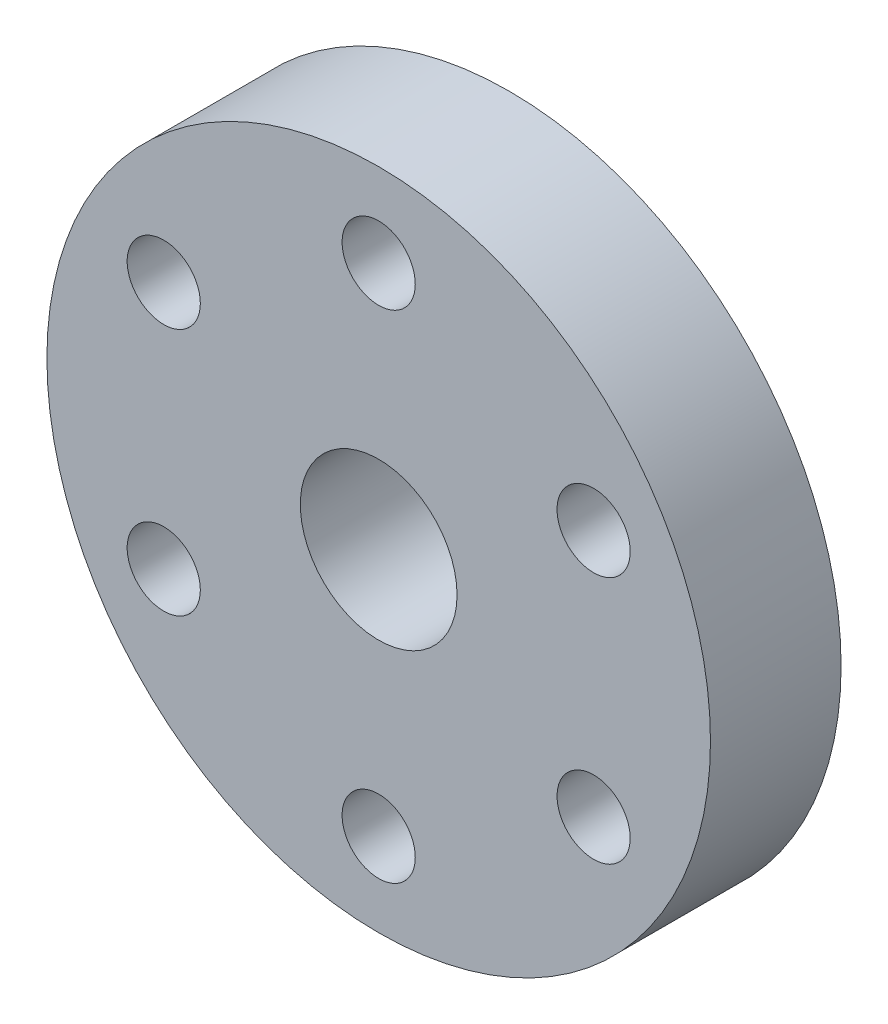
ISO-10303-21;
HEADER;
FILE_DESCRIPTION(('STEP AP214'),'2;1');
FILE_NAME('part.step','',(''),(''),'','','');
FILE_SCHEMA(('AUTOMOTIVE_DESIGN { 1 0 10303 214 1 1 1 1 }'));
ENDSEC;
DATA;
#1=APPLICATION_CONTEXT('core data for automotive mechanical design processes');
#2=APPLICATION_PROTOCOL_DEFINITION('international standard','automotive_design',2000,#1);
#3=PRODUCT_CONTEXT('',#1,'mechanical');
#4=PRODUCT('Part','Part','',(#3));
#5=PRODUCT_RELATED_PRODUCT_CATEGORY('part','',(#4));
#6=PRODUCT_DEFINITION_FORMATION('','',#4);
#7=PRODUCT_DEFINITION_CONTEXT('part definition',#1,'design');
#8=PRODUCT_DEFINITION('design','',#6,#7);
#9=PRODUCT_DEFINITION_SHAPE('','',#8);
#10=(LENGTH_UNIT() NAMED_UNIT(*) SI_UNIT(.MILLI.,.METRE.));
#11=(NAMED_UNIT(*) PLANE_ANGLE_UNIT() SI_UNIT($,.RADIAN.));
#12=(NAMED_UNIT(*) SI_UNIT($,.STERADIAN.) SOLID_ANGLE_UNIT());
#13=UNCERTAINTY_MEASURE_WITH_UNIT(LENGTH_MEASURE(1.E-05),#10,'distance_accuracy_value','');
#14=(GEOMETRIC_REPRESENTATION_CONTEXT(3) GLOBAL_UNCERTAINTY_ASSIGNED_CONTEXT((#13)) GLOBAL_UNIT_ASSIGNED_CONTEXT((#10,
#11,#12)) REPRESENTATION_CONTEXT('',''));
#15=CARTESIAN_POINT('',(0.,0.,0.));
#16=DIRECTION('',(0.,0.,1.));
#17=DIRECTION('',(1.,0.,0.));
#18=AXIS2_PLACEMENT_3D('',#15,#16,#17);
#19=CARTESIAN_POINT('',(0.,0.,0.));
#20=DIRECTION('',(0.,0.,1.));
#21=DIRECTION('',(1.,0.,0.));
#22=AXIS2_PLACEMENT_3D('',#19,#20,#21);
#23=PLANE('',#22);
#24=CARTESIAN_POINT('',(0.,0.,0.));
#25=DIRECTION('',(0.,0.,1.));
#26=DIRECTION('',(1.,0.,0.));
#27=AXIS2_PLACEMENT_3D('',#24,#25,#26);
#28=CIRCLE('',#27,6.);
#29=CARTESIAN_POINT('',(6.,0.,0.));
#30=VERTEX_POINT('',#29);
#31=EDGE_CURVE('E47',#30,#30,#28,.T.);
#32=ORIENTED_EDGE('',*,*,#31,.F.);
#33=EDGE_LOOP('',(#32));
#34=FACE_BOUND('',#33,.T.);
#35=CARTESIAN_POINT('',(0.,0.,0.));
#36=DIRECTION('',(0.,0.,1.));
#37=DIRECTION('',(1.,0.,0.));
#38=AXIS2_PLACEMENT_3D('',#35,#36,#37);
#39=CIRCLE('',#38,3.);
#40=CARTESIAN_POINT('',(3.,0.,0.));
#41=VERTEX_POINT('',#40);
#42=EDGE_CURVE('E52',#41,#41,#39,.T.);
#43=ORIENTED_EDGE('',*,*,#42,.T.);
#44=EDGE_LOOP('',(#43));
#45=FACE_BOUND('',#44,.T.);
#46=ADVANCED_FACE('F34',(#34,#45),#23,.F.);
#47=CARTESIAN_POINT('',(0.,0.,4.2));
#48=DIRECTION('',(0.,0.,-1.));
#49=DIRECTION('',(-1.,0.,0.));
#50=AXIS2_PLACEMENT_3D('',#47,#48,#49);
#51=CYLINDRICAL_SURFACE('',#50,6.);
#52=CARTESIAN_POINT('',(0.,-6.,3.5));
#53=CARTESIAN_POINT('',(0.0775136551808606,-5.99999860462077,3.49999755049782));
#54=CARTESIAN_POINT('',(0.155055852180418,-5.99848277720663,3.49354075895642));
#55=CARTESIAN_POINT('',(0.307928711689404,-5.99258245110673,3.46791633869285));
#56=CARTESIAN_POINT('',(0.383257908738774,-5.98819609437492,3.44874047701852));
#57=CARTESIAN_POINT('',(0.529474135819814,-5.97704189804572,3.39831831024663));
#58=CARTESIAN_POINT('',(0.600366020559867,-5.97027671664972,3.3670854743364));
#59=CARTESIAN_POINT('',(0.735902456221209,-5.95509063862421,3.29348083405209));
#60=CARTESIAN_POINT('',(0.800546997673411,-5.94666973948518,3.25110901279503));
#61=CARTESIAN_POINT('',(0.922925959248793,-5.92892044055307,3.15561764001887));
#62=CARTESIAN_POINT('',(0.980531045796356,-5.91957951935363,3.10233465382949));
#63=CARTESIAN_POINT('',(1.08607323847069,-5.90112886617325,2.98688389689762));
#64=CARTESIAN_POINT('',(1.13400938392729,-5.89201915724322,2.92471524435569));
#65=CARTESIAN_POINT('',(1.21944051732307,-5.87493771504315,2.79227998295129));
#66=CARTESIAN_POINT('',(1.25679466710317,-5.86698196255307,2.72192027567549));
#67=CARTESIAN_POINT('',(1.31909703704768,-5.85329030120377,2.57570531126446));
#68=CARTESIAN_POINT('',(1.34404696295362,-5.84755408715332,2.49985081137896));
#69=CARTESIAN_POINT('',(1.38039896443522,-5.83907906254273,2.34621138233285));
#70=CARTESIAN_POINT('',(1.39203167018675,-5.83628929295491,2.26848389510077));
#71=CARTESIAN_POINT('',(1.40213672759817,-5.83387021717826,2.11213439110955));
#72=CARTESIAN_POINT('',(1.40061093007045,-5.83424046651614,2.03351250170633));
#73=CARTESIAN_POINT('',(1.38462717006806,-5.83805360607404,1.87934410285429));
#74=CARTESIAN_POINT('',(1.37044019131594,-5.84143210805626,1.80376766136065));
#75=CARTESIAN_POINT('',(1.32996743878963,-5.85077891648779,1.65609814039352));
#76=CARTESIAN_POINT('',(1.30368090292846,-5.85674738606408,1.58400528064847));
#77=CARTESIAN_POINT('',(1.23951455308861,-5.87066310630364,1.44460351510235));
#78=CARTESIAN_POINT('',(1.20153320055199,-5.87862756950202,1.37734313734968));
#79=CARTESIAN_POINT('',(1.11512658099994,-5.89562771298769,1.25005155389481));
#80=CARTESIAN_POINT('',(1.06669970611106,-5.90466355809567,1.19002146336614));
#81=CARTESIAN_POINT('',(0.959356121021581,-5.92306231054005,1.07733750874245));
#82=CARTESIAN_POINT('',(0.900209750657103,-5.93242778207154,1.02490259657541));
#83=CARTESIAN_POINT('',(0.77385399055564,-5.95022809072843,0.93065747543382));
#84=CARTESIAN_POINT('',(0.706644412992491,-5.95866290616613,0.888847514030046));
#85=CARTESIAN_POINT('',(0.565782506984416,-5.97368513329122,0.816973308242645));
#86=CARTESIAN_POINT('',(0.492113392403213,-5.98026753264178,0.786940847183003));
#87=CARTESIAN_POINT('',(0.340585615176868,-5.99080645286014,0.739744288534925));
#88=CARTESIAN_POINT('',(0.262727650306185,-5.99476340961636,0.72257805477302));
#89=CARTESIAN_POINT('',(0.106907588460029,-5.99954244402773,0.70192686366759));
#90=CARTESIAN_POINT('',(0.0289871166552413,-6.00043294383207,0.698143245718862));
#91=CARTESIAN_POINT('',(-0.126372845528744,-5.99917188382708,0.703550834630745));
#92=CARTESIAN_POINT('',(-0.203812372830682,-5.99702056051609,0.7127410327916));
#93=CARTESIAN_POINT('',(-0.355000856153422,-5.98996106858808,0.74358830502789));
#94=CARTESIAN_POINT('',(-0.428784148664062,-5.9850881879476,0.765085887975081));
#95=CARTESIAN_POINT('',(-0.571695899544112,-5.97313240187964,0.819758347367704));
#96=CARTESIAN_POINT('',(-0.640823925050002,-5.96604929128103,0.852934307929705));
#97=CARTESIAN_POINT('',(-0.773676865632761,-5.95029195840437,0.930624301545468));
#98=CARTESIAN_POINT('',(-0.837298480893235,-5.9415942435686,0.975310106522388));
#99=CARTESIAN_POINT('',(-0.956246790292011,-5.92361520942204,1.07452818776419));
#100=CARTESIAN_POINT('',(-1.01157224539757,-5.91433380323009,1.1290619321447));
#101=CARTESIAN_POINT('',(-1.11356143853837,-5.89599253653189,1.24780629554065));
#102=CARTESIAN_POINT('',(-1.16001705897302,-5.8869415232112,1.31219730279702));
#103=CARTESIAN_POINT('',(-1.24145867752415,-5.87030791238069,1.44804081164209));
#104=CARTESIAN_POINT('',(-1.27644518731706,-5.8627252493689,1.51949299802219));
#105=CARTESIAN_POINT('',(-1.33370534540389,-5.84996505463622,1.66704045999628));
#106=CARTESIAN_POINT('',(-1.35605325740337,-5.84477350703676,1.74310564180338));
#107=CARTESIAN_POINT('',(-1.38761099409425,-5.83736270589205,1.89805048375049));
#108=CARTESIAN_POINT('',(-1.39682325969457,-5.83514290013266,1.97692961819947));
#109=CARTESIAN_POINT('',(-1.40173339100697,-5.8339650668052,2.1331565495));
#110=CARTESIAN_POINT('',(-1.39776234943619,-5.83492712585111,2.21049351644876));
#111=CARTESIAN_POINT('',(-1.3771667082819,-5.83982206816926,2.36336303979087));
#112=CARTESIAN_POINT('',(-1.36054230260668,-5.84375490591537,2.43889562381744));
#113=CARTESIAN_POINT('',(-1.31528151618139,-5.85410673416447,2.58570549046038));
#114=CARTESIAN_POINT('',(-1.28669962480293,-5.86051443684696,2.65700042145178));
#115=CARTESIAN_POINT('',(-1.2183798684127,-5.87509704008543,2.79382999595179));
#116=CARTESIAN_POINT('',(-1.17864066141223,-5.88327215319622,2.85936394529051));
#117=CARTESIAN_POINT('',(-1.08806343467475,-5.90070227653374,2.98442910308178));
#118=CARTESIAN_POINT('',(-1.03699221748307,-5.9099777197338,3.04378860408992));
#119=CARTESIAN_POINT('',(-0.925665237986201,-5.92843331002946,3.15320306160817));
#120=CARTESIAN_POINT('',(-0.865407334621453,-5.93761343437582,3.20325584303191));
#121=CARTESIAN_POINT('',(-0.736311376134255,-5.95501024549108,3.29337181261718));
#122=CARTESIAN_POINT('',(-0.667356718680486,-5.96321014750897,3.33327141389703));
#123=CARTESIAN_POINT('',(-0.523538263687533,-5.97755068140178,3.40084956861957));
#124=CARTESIAN_POINT('',(-0.448679156038939,-5.98369292771758,3.42853770862458));
#125=CARTESIAN_POINT('',(-0.311528184180862,-5.99221392489556,3.46634021560558));
#126=CARTESIAN_POINT('',(-0.249940948576286,-5.99511474612675,3.47893714788107));
#127=CARTESIAN_POINT('',(-0.125575340933341,-5.99900829461443,3.49576779433718));
#128=CARTESIAN_POINT('',(-0.0627970368842883,-6.00000113045477,3.50000198444363));
#129=CARTESIAN_POINT('',(0.,-6.,3.5));
#130=B_SPLINE_CURVE_WITH_KNOTS('',3,(#52,#53,#54,#55,#56,#57,#58,#59,#60,#61,#62,#63,#64,#65,
#66,#67,#68,#69,#70,#71,#72,#73,#74,#75,#76,#77,#78,#79,#80,#81,#82,#83,#84,#85,#86,#87,#88,#89,
#90,#91,#92,#93,#94,#95,#96,#97,#98,#99,#100,#101,#102,#103,#104,#105,#106,#107,#108,#109,#110,
#111,#112,#113,#114,#115,#116,#117,#118,#119,#120,#121,#122,#123,#124,#125,#126,#127,#128,#129),
.UNSPECIFIED.,.T.,.F.,(4,2,2,2,2,2,2,2,2,2,2,2,2,2,2,2,2,2,2,2,2,2,2,2,2,2,2,2,2,2,2,2,2,2,2,2,
2,2,4),(0.,0.232310985919359,0.464772491816953,0.696975056396176,0.929177972918811,
1.16515351438317,1.4011524899667,1.64015884953452,1.87913233353337,2.11390145918228,
2.34863756386325,2.57846705193038,2.8083110177202,3.04020969694585,3.27214409771247,
3.50981031406085,3.74748206773496,3.98579087118959,4.22406009957936,4.45697708738846,
4.68987596715844,4.9198229082951,5.14979120128962,5.38341339123567,5.61707043801289,
5.85567302562694,6.09426496691076,6.33143998718595,6.5685709290746,6.79979193674362,
7.03100940110476,7.2611845077494,7.49138731145205,7.72685864048367,7.9623849328642,
8.20149492533847,8.44041686981216,8.62863237610634,8.81683717069852),.UNSPECIFIED.);
#131=CARTESIAN_POINT('',(0.,-6.,3.5));
#132=VERTEX_POINT('',#131);
#133=EDGE_CURVE('E65',#132,#132,#130,.T.);
#134=ORIENTED_EDGE('',*,*,#133,.T.);
#135=EDGE_LOOP('',(#134));
#136=FACE_BOUND('',#135,.T.);
#137=CARTESIAN_POINT('',(0.,0.,4.2));
#138=DIRECTION('',(0.,0.,1.));
#139=DIRECTION('',(1.,0.,0.));
#140=AXIS2_PLACEMENT_3D('',#137,#138,#139);
#141=CIRCLE('',#140,6.);
#142=CARTESIAN_POINT('',(6.,0.,4.2));
#143=VERTEX_POINT('',#142);
#144=EDGE_CURVE('E10',#143,#143,#141,.T.);
#145=ORIENTED_EDGE('',*,*,#144,.F.);
#146=EDGE_LOOP('',(#145));
#147=FACE_BOUND('',#146,.T.);
#148=ORIENTED_EDGE('',*,*,#31,.T.);
#149=EDGE_LOOP('',(#148));
#150=FACE_BOUND('',#149,.T.);
#151=ADVANCED_FACE('F36',(#136,#147,#150),#51,.T.);
#152=CARTESIAN_POINT('',(0.,0.,4.2));
#153=DIRECTION('',(0.,0.,-1.));
#154=DIRECTION('',(-1.,0.,0.));
#155=AXIS2_PLACEMENT_3D('',#152,#153,#154);
#156=CYLINDRICAL_SURFACE('',#155,3.);
#157=CARTESIAN_POINT('',(0.,-3.,3.5));
#158=CARTESIAN_POINT('',(0.074176014195853,-2.9999965985567,3.49999594944587));
#159=CARTESIAN_POINT('',(0.148457438343158,-2.99721866421499,3.49407017916472));
#160=CARTESIAN_POINT('',(0.294860958042639,-2.98638133101226,3.47061224072665));
#161=CARTESIAN_POINT('',(0.366977899485661,-2.97831023303417,3.45305436203902));
#162=CARTESIAN_POINT('',(0.506705207958354,-2.95773878056305,3.40714824486611));
#163=CARTESIAN_POINT('',(0.574331184032727,-2.94525483671525,3.37883995676572));
#164=CARTESIAN_POINT('',(0.703790652559756,-2.91703179641225,3.3124256993013));
#165=CARTESIAN_POINT('',(0.765625113804207,-2.90129324579851,3.27432137260479));
#166=CARTESIAN_POINT('',(0.885556018232679,-2.86703510505487,3.18700931632246));
#167=CARTESIAN_POINT('',(0.943262854198595,-2.84841047078529,3.13730816073342));
#168=CARTESIAN_POINT('',(1.04987206669058,-2.81086626705385,3.02926581284594));
#169=CARTESIAN_POINT('',(1.09876864666266,-2.79194651225135,2.97091897793868));
#170=CARTESIAN_POINT('',(1.18954928643585,-2.75454886272565,2.84265632770077));
#171=CARTESIAN_POINT('',(1.23076801131511,-2.73618026181933,2.77223417349252));
#172=CARTESIAN_POINT('',(1.30060459631542,-2.70368671328044,2.62449166583378));
#173=CARTESIAN_POINT('',(1.32923050054668,-2.68955905843085,2.54717575409304));
#174=CARTESIAN_POINT('',(1.37136389166292,-2.66831280778357,2.3922913308142));
#175=CARTESIAN_POINT('',(1.38562630954338,-2.66084688805232,2.31497798660206));
#176=CARTESIAN_POINT('',(1.4009643178012,-2.65280653141493,2.1587238445313));
#177=CARTESIAN_POINT('',(1.4020501890138,-2.65222672171534,2.07978436362683));
#178=CARTESIAN_POINT('',(1.39156325474428,-2.6577381391041,1.93104782259268));
#179=CARTESIAN_POINT('',(1.38125548710099,-2.66316277668237,1.86113132367479));
#180=CARTESIAN_POINT('',(1.35043639237287,-2.67892103840313,1.72416592160718));
#181=CARTESIAN_POINT('',(1.32992244300339,-2.68925592410991,1.65711776023274));
#182=CARTESIAN_POINT('',(1.27887161255287,-2.71390923378543,1.52592780866886));
#183=CARTESIAN_POINT('',(1.24811450695909,-2.7283140240837,1.46188869599852));
#184=CARTESIAN_POINT('',(1.17761205733664,-2.75947702819645,1.33959400364931));
#185=CARTESIAN_POINT('',(1.13786278548149,-2.77623626923161,1.28134096740936));
#186=CARTESIAN_POINT('',(1.04545769592096,-2.81242518177222,1.16561325724133));
#187=CARTESIAN_POINT('',(0.991869135627384,-2.83194722846672,1.10890981132952));
#188=CARTESIAN_POINT('',(0.875809338201001,-2.86996272516678,1.00499883889947));
#189=CARTESIAN_POINT('',(0.813334864133948,-2.88845579691007,0.957794787991446));
#190=CARTESIAN_POINT('',(0.678420066791913,-2.92314231667083,0.872674741990081));
#191=CARTESIAN_POINT('',(0.605704043903011,-2.9392303997136,0.835149439534242));
#192=CARTESIAN_POINT('',(0.454047875045107,-2.9664385628126,0.773147281488888));
#193=CARTESIAN_POINT('',(0.375112098848906,-2.97756209480586,0.748661357101825));
#194=CARTESIAN_POINT('',(0.219630179590064,-2.99289168727817,0.715224614513687));
#195=CARTESIAN_POINT('',(0.143350867486889,-2.99755511855446,0.70524384224663));
#196=CARTESIAN_POINT('',(-0.00993159603062645,-3.00096130674055,0.697936660080451));
#197=CARTESIAN_POINT('',(-0.0869344549310046,-2.99970636153703,0.700605338869388));
#198=CARTESIAN_POINT('',(-0.234138662301146,-2.99169876992405,0.717859772256281));
#199=CARTESIAN_POINT('',(-0.304455247280262,-2.98531143610107,0.731653879274028));
#200=CARTESIAN_POINT('',(-0.441661374952198,-2.9681169868393,0.769585296470063));
#201=CARTESIAN_POINT('',(-0.508550515457683,-2.95730935403885,0.793723817397478));
#202=CARTESIAN_POINT('',(-0.639346310572959,-2.93186182190092,0.852389399888318));
#203=CARTESIAN_POINT('',(-0.703098749779368,-2.91711463217098,0.887212149985572));
#204=CARTESIAN_POINT('',(-0.824081336424187,-2.88527461622476,0.965934427053035));
#205=CARTESIAN_POINT('',(-0.881308600637792,-2.86818076040266,1.00983794254021));
#206=CARTESIAN_POINT('',(-0.992927203863406,-2.83157928041133,1.10995057808188));
#207=CARTESIAN_POINT('',(-1.04662821994276,-2.81199150907127,1.16690174669527));
#208=CARTESIAN_POINT('',(-1.14397488618524,-2.7738171204936,1.28917794714694));
#209=CARTESIAN_POINT('',(-1.18761573536873,-2.7552309844915,1.35450695406384));
#210=CARTESIAN_POINT('',(-1.26487258942864,-2.72065279755534,1.4944537387633));
#211=CARTESIAN_POINT('',(-1.29811762077689,-2.70476441122083,1.5693040329686));
#212=CARTESIAN_POINT('',(-1.35119476914698,-2.67864935946574,1.7245260622962));
#213=CARTESIAN_POINT('',(-1.37104172650419,-2.6684164320798,1.80489157939704));
#214=CARTESIAN_POINT('',(-1.39512361569359,-2.65589863089785,1.96107554771441));
#215=CARTESIAN_POINT('',(-1.40060458275626,-2.65298045006346,2.03665086073106));
#216=CARTESIAN_POINT('',(-1.39928993042139,-2.65367487263324,2.18765382327));
#217=CARTESIAN_POINT('',(-1.39249775922279,-2.65728564169681,2.26308150830889));
#218=CARTESIAN_POINT('',(-1.36795238910772,-2.66999487603889,2.40590006248366));
#219=CARTESIAN_POINT('',(-1.35103435582632,-2.67867409395688,2.47347595929578));
#220=CARTESIAN_POINT('',(-1.30765598987226,-2.70011439829818,2.60479828460279));
#221=CARTESIAN_POINT('',(-1.28119281477063,-2.71287670048705,2.66854356578271));
#222=CARTESIAN_POINT('',(-1.21748406199402,-2.74208602331761,2.7950365450524));
#223=CARTESIAN_POINT('',(-1.1796403806501,-2.75872111955289,2.85743847762141));
#224=CARTESIAN_POINT('',(-1.0949742620724,-2.79340714138716,2.97538981444124));
#225=CARTESIAN_POINT('',(-1.04814763276814,-2.81145872568485,3.03093599935386));
#226=CARTESIAN_POINT('',(-0.941307680520032,-2.8491150891186,3.13937361999567));
#227=CARTESIAN_POINT('',(-0.880442612871034,-2.86869394428718,3.1914392587178));
#228=CARTESIAN_POINT('',(-0.750199086477079,-2.90547332461736,3.28474343285123));
#229=CARTESIAN_POINT('',(-0.680816600685456,-2.92267271652822,3.32597681760483));
#230=CARTESIAN_POINT('',(-0.535611024288787,-2.95272548252542,3.39598749798326));
#231=CARTESIAN_POINT('',(-0.459824309977941,-2.96560157678301,3.42483014166356));
#232=CARTESIAN_POINT('',(-0.303822742627249,-2.98560363061672,3.46902274354933));
#233=CARTESIAN_POINT('',(-0.223621832238217,-2.99274669700571,3.48441285517442));
#234=CARTESIAN_POINT('',(-0.118989792805177,-2.99773444736987,3.49513901457568));
#235=CARTESIAN_POINT('',(-0.0952397688918332,-2.99858232619917,3.49695990001916));
#236=CARTESIAN_POINT('',(-0.047663459625105,-2.99971565466794,3.49939105564999));
#237=CARTESIAN_POINT('',(-0.0238371727597297,-3.00000109308639,3.50000130168437));
#238=CARTESIAN_POINT('',(0.,-3.,3.5));
#239=B_SPLINE_CURVE_WITH_KNOTS('',3,(#157,#158,#159,#160,#161,#162,#163,#164,#165,#166,#167,
#168,#169,#170,#171,#172,#173,#174,#175,#176,#177,#178,#179,#180,#181,#182,#183,#184,#185,#186,
#187,#188,#189,#190,#191,#192,#193,#194,#195,#196,#197,#198,#199,#200,#201,#202,#203,#204,#205,
#206,#207,#208,#209,#210,#211,#212,#213,#214,#215,#216,#217,#218,#219,#220,#221,#222,#223,#224,
#225,#226,#227,#228,#229,#230,#231,#232,#233,#234,#235,#236,#237,#238),.UNSPECIFIED.,.T.,.F.,(4,
2,2,2,2,2,2,2,2,2,2,2,2,2,2,2,2,2,2,2,2,2,2,2,2,2,2,2,2,2,2,2,2,2,2,2,2,2,2,2,4),(0.,
0.222430614227101,0.445354516020344,0.667457974459496,0.889524213319483,1.12374008349084,
1.3581094936473,1.60776429290693,1.8572593839249,2.09282314699248,2.32820310256044,
2.53985531348055,2.75156193252273,2.96815060600377,3.18483406988205,3.42504393482463,
3.66534152788207,3.91419776760519,4.16288070273416,4.392858842168,4.62274769694935,
4.83758576938905,5.05244899415581,5.27389671638204,5.49544191175845,5.73644174754948,
5.97755635787823,6.2264897623231,6.47514698203737,6.70138965858241,6.92756878101077,
7.13725924988263,7.34701221368888,7.57065894835865,7.79441030722339,8.0406156991707,
8.28693794895593,8.53194466707524,8.7762175616393,8.84769634435319,8.9191765530954),.UNSPECIFIED.);
#240=CARTESIAN_POINT('',(0.,-3.,3.5));
#241=VERTEX_POINT('',#240);
#242=EDGE_CURVE('E39',#241,#241,#239,.T.);
#243=ORIENTED_EDGE('',*,*,#242,.F.);
#244=EDGE_LOOP('',(#243));
#245=FACE_BOUND('',#244,.T.);
#246=ORIENTED_EDGE('',*,*,#42,.F.);
#247=EDGE_LOOP('',(#246));
#248=FACE_BOUND('',#247,.T.);
#249=CARTESIAN_POINT('',(0.,0.,9.2));
#250=DIRECTION('',(0.,0.,1.));
#251=DIRECTION('',(1.,0.,0.));
#252=AXIS2_PLACEMENT_3D('',#249,#250,#251);
#253=CIRCLE('',#252,3.);
#254=CARTESIAN_POINT('',(3.,0.,9.2));
#255=VERTEX_POINT('',#254);
#256=EDGE_CURVE('E60',#255,#255,#253,.T.);
#257=ORIENTED_EDGE('',*,*,#256,.T.);
#258=EDGE_LOOP('',(#257));
#259=FACE_BOUND('',#258,.T.);
#260=ADVANCED_FACE('F89',(#245,#248,#259),#156,.F.);
#261=CARTESIAN_POINT('',(0.,0.,4.2));
#262=DIRECTION('',(0.,0.,1.));
#263=DIRECTION('',(1.,0.,0.));
#264=AXIS2_PLACEMENT_3D('',#261,#262,#263);
#265=PLANE('',#264);
#266=CARTESIAN_POINT('',(-8.22724133595197,4.74999999999964,4.2));
#267=DIRECTION('',(0.,0.,1.));
#268=DIRECTION('',(1.,0.,0.));
#269=AXIS2_PLACEMENT_3D('',#266,#267,#268);
#270=CIRCLE('',#269,1.40000000000041);
#271=CARTESIAN_POINT('',(-6.82724133595156,4.74999999999964,4.2));
#272=VERTEX_POINT('',#271);
#273=EDGE_CURVE('E216',#272,#272,#270,.T.);
#274=ORIENTED_EDGE('',*,*,#273,.T.);
#275=EDGE_LOOP('',(#274));
#276=FACE_BOUND('',#275,.T.);
#277=CARTESIAN_POINT('',(-8.22724133595156,-4.75000000000035,4.2));
#278=DIRECTION('',(0.,0.,1.));
#279=DIRECTION('',(1.,0.,0.));
#280=AXIS2_PLACEMENT_3D('',#277,#278,#279);
#281=CIRCLE('',#280,1.40000000000077);
#282=CARTESIAN_POINT('',(-6.82724133595079,-4.75000000000035,4.2));
#283=VERTEX_POINT('',#282);
#284=EDGE_CURVE('E224',#283,#283,#281,.T.);
#285=ORIENTED_EDGE('',*,*,#284,.T.);
#286=EDGE_LOOP('',(#285));
#287=FACE_BOUND('',#286,.T.);
#288=CARTESIAN_POINT('',(8.07691889848134E-13,-9.5,4.2));
#289=DIRECTION('',(0.,0.,1.));
#290=DIRECTION('',(1.,0.,0.));
#291=AXIS2_PLACEMENT_3D('',#288,#289,#290);
#292=CIRCLE('',#291,1.40000000000084);
#293=CARTESIAN_POINT('',(1.40000000000164,-9.5,4.2));
#294=VERTEX_POINT('',#293);
#295=EDGE_CURVE('E230',#294,#294,#292,.T.);
#296=ORIENTED_EDGE('',*,*,#295,.T.);
#297=EDGE_LOOP('',(#296));
#298=FACE_BOUND('',#297,.T.);
#299=CARTESIAN_POINT('',(8.22724133595277,-4.74999999999965,4.2));
#300=DIRECTION('',(0.,0.,1.));
#301=DIRECTION('',(1.,0.,0.));
#302=AXIS2_PLACEMENT_3D('',#299,#300,#301);
#303=CIRCLE('',#302,1.40000000000052);
#304=CARTESIAN_POINT('',(9.6272413359533,-4.74999999999965,4.2));
#305=VERTEX_POINT('',#304);
#306=EDGE_CURVE('E236',#305,#305,#303,.T.);
#307=ORIENTED_EDGE('',*,*,#306,.T.);
#308=EDGE_LOOP('',(#307));
#309=FACE_BOUND('',#308,.T.);
#310=CARTESIAN_POINT('',(8.22724133595237,4.75000000000035,4.2));
#311=DIRECTION('',(0.,0.,1.));
#312=DIRECTION('',(1.,0.,0.));
#313=AXIS2_PLACEMENT_3D('',#310,#311,#312);
#314=CIRCLE('',#313,1.40000000000012);
#315=CARTESIAN_POINT('',(9.62724133595248,4.75000000000035,4.2));
#316=VERTEX_POINT('',#315);
#317=EDGE_CURVE('E242',#316,#316,#314,.T.);
#318=ORIENTED_EDGE('',*,*,#317,.T.);
#319=EDGE_LOOP('',(#318));
#320=FACE_BOUND('',#319,.T.);
#321=CARTESIAN_POINT('',(0.,9.5,4.2));
#322=DIRECTION('',(0.,0.,1.));
#323=DIRECTION('',(1.,0.,0.));
#324=AXIS2_PLACEMENT_3D('',#321,#322,#323);
#325=CIRCLE('',#324,1.4);
#326=CARTESIAN_POINT('',(1.4,9.5,4.2));
#327=VERTEX_POINT('',#326);
#328=EDGE_CURVE('E246',#327,#327,#325,.T.);
#329=ORIENTED_EDGE('',*,*,#328,.T.);
#330=EDGE_LOOP('',(#329));
#331=FACE_BOUND('',#330,.T.);
#332=CARTESIAN_POINT('',(0.,0.,4.2));
#333=DIRECTION('',(0.,0.,1.));
#334=DIRECTION('',(1.,0.,0.));
#335=AXIS2_PLACEMENT_3D('',#332,#333,#334);
#336=CIRCLE('',#335,12.7);
#337=CARTESIAN_POINT('',(12.7,0.,4.2));
#338=VERTEX_POINT('',#337);
#339=EDGE_CURVE('E57',#338,#338,#336,.T.);
#340=ORIENTED_EDGE('',*,*,#339,.F.);
#341=EDGE_LOOP('',(#340));
#342=FACE_BOUND('',#341,.T.);
#343=ORIENTED_EDGE('',*,*,#144,.T.);
#344=EDGE_LOOP('',(#343));
#345=FACE_BOUND('',#344,.T.);
#346=ADVANCED_FACE('F85',(#276,#287,#298,#309,#320,#331,#342,#345),#265,.F.);
#347=CARTESIAN_POINT('',(0.,0.,9.2));
#348=DIRECTION('',(0.,0.,1.));
#349=DIRECTION('',(1.,0.,0.));
#350=AXIS2_PLACEMENT_3D('',#347,#348,#349);
#351=PLANE('',#350);
#352=CARTESIAN_POINT('',(-8.22724133595197,4.74999999999964,9.2));
#353=DIRECTION('',(0.,0.,1.));
#354=DIRECTION('',(1.,0.,0.));
#355=AXIS2_PLACEMENT_3D('',#352,#353,#354);
#356=CIRCLE('',#355,1.40000000000041);
#357=CARTESIAN_POINT('',(-6.82724133595156,4.74999999999964,9.2));
#358=VERTEX_POINT('',#357);
#359=EDGE_CURVE('E219',#358,#358,#356,.T.);
#360=ORIENTED_EDGE('',*,*,#359,.F.);
#361=EDGE_LOOP('',(#360));
#362=FACE_BOUND('',#361,.T.);
#363=CARTESIAN_POINT('',(-8.22724133595156,-4.75000000000035,9.2));
#364=DIRECTION('',(0.,0.,1.));
#365=DIRECTION('',(1.,0.,0.));
#366=AXIS2_PLACEMENT_3D('',#363,#364,#365);
#367=CIRCLE('',#366,1.40000000000077);
#368=CARTESIAN_POINT('',(-6.82724133595079,-4.75000000000035,9.2));
#369=VERTEX_POINT('',#368);
#370=EDGE_CURVE('E221',#369,#369,#367,.T.);
#371=ORIENTED_EDGE('',*,*,#370,.F.);
#372=EDGE_LOOP('',(#371));
#373=FACE_BOUND('',#372,.T.);
#374=CARTESIAN_POINT('',(8.07691889848134E-13,-9.5,9.2));
#375=DIRECTION('',(0.,0.,1.));
#376=DIRECTION('',(1.,0.,0.));
#377=AXIS2_PLACEMENT_3D('',#374,#375,#376);
#378=CIRCLE('',#377,1.40000000000084);
#379=CARTESIAN_POINT('',(1.40000000000164,-9.5,9.2));
#380=VERTEX_POINT('',#379);
#381=EDGE_CURVE('E227',#380,#380,#378,.T.);
#382=ORIENTED_EDGE('',*,*,#381,.F.);
#383=EDGE_LOOP('',(#382));
#384=FACE_BOUND('',#383,.T.);
#385=CARTESIAN_POINT('',(8.22724133595277,-4.74999999999965,9.2));
#386=DIRECTION('',(0.,0.,1.));
#387=DIRECTION('',(1.,0.,0.));
#388=AXIS2_PLACEMENT_3D('',#385,#386,#387);
#389=CIRCLE('',#388,1.40000000000052);
#390=CARTESIAN_POINT('',(9.6272413359533,-4.74999999999965,9.2));
#391=VERTEX_POINT('',#390);
#392=EDGE_CURVE('E233',#391,#391,#389,.T.);
#393=ORIENTED_EDGE('',*,*,#392,.F.);
#394=EDGE_LOOP('',(#393));
#395=FACE_BOUND('',#394,.T.);
#396=CARTESIAN_POINT('',(8.22724133595237,4.75000000000035,9.2));
#397=DIRECTION('',(0.,0.,1.));
#398=DIRECTION('',(1.,0.,0.));
#399=AXIS2_PLACEMENT_3D('',#396,#397,#398);
#400=CIRCLE('',#399,1.40000000000012);
#401=CARTESIAN_POINT('',(9.62724133595248,4.75000000000035,9.2));
#402=VERTEX_POINT('',#401);
#403=EDGE_CURVE('E239',#402,#402,#400,.T.);
#404=ORIENTED_EDGE('',*,*,#403,.F.);
#405=EDGE_LOOP('',(#404));
#406=FACE_BOUND('',#405,.T.);
#407=CARTESIAN_POINT('',(0.,9.5,9.2));
#408=DIRECTION('',(0.,0.,1.));
#409=DIRECTION('',(1.,0.,0.));
#410=AXIS2_PLACEMENT_3D('',#407,#408,#409);
#411=CIRCLE('',#410,1.4);
#412=CARTESIAN_POINT('',(1.4,9.5,9.2));
#413=VERTEX_POINT('',#412);
#414=EDGE_CURVE('E70',#413,#413,#411,.T.);
#415=ORIENTED_EDGE('',*,*,#414,.F.);
#416=EDGE_LOOP('',(#415));
#417=FACE_BOUND('',#416,.T.);
#418=CARTESIAN_POINT('',(0.,0.,9.2));
#419=DIRECTION('',(0.,0.,1.));
#420=DIRECTION('',(1.,0.,0.));
#421=AXIS2_PLACEMENT_3D('',#418,#419,#420);
#422=CIRCLE('',#421,12.7);
#423=CARTESIAN_POINT('',(12.7,0.,9.2));
#424=VERTEX_POINT('',#423);
#425=EDGE_CURVE('E56',#424,#424,#422,.T.);
#426=ORIENTED_EDGE('',*,*,#425,.T.);
#427=EDGE_LOOP('',(#426));
#428=FACE_BOUND('',#427,.T.);
#429=ORIENTED_EDGE('',*,*,#256,.F.);
#430=EDGE_LOOP('',(#429));
#431=FACE_BOUND('',#430,.T.);
#432=ADVANCED_FACE('F81',(#362,#373,#384,#395,#406,#417,#428,#431),#351,.T.);
#433=CARTESIAN_POINT('',(0.,0.,9.2));
#434=DIRECTION('',(0.,0.,-1.));
#435=DIRECTION('',(-1.,0.,0.));
#436=AXIS2_PLACEMENT_3D('',#433,#434,#435);
#437=CYLINDRICAL_SURFACE('',#436,12.7);
#438=ORIENTED_EDGE('',*,*,#425,.F.);
#439=EDGE_LOOP('',(#438));
#440=FACE_BOUND('',#439,.T.);
#441=ORIENTED_EDGE('',*,*,#339,.T.);
#442=EDGE_LOOP('',(#441));
#443=FACE_BOUND('',#442,.T.);
#444=ADVANCED_FACE('F78',(#440,#443),#437,.T.);
#445=CARTESIAN_POINT('',(0.,-12.7,2.1));
#446=DIRECTION('',(0.,1.,0.));
#447=DIRECTION('',(0.,0.,1.));
#448=AXIS2_PLACEMENT_3D('',#445,#446,#447);
#449=CYLINDRICAL_SURFACE('',#448,1.4);
#450=ORIENTED_EDGE('',*,*,#242,.T.);
#451=EDGE_LOOP('',(#450));
#452=FACE_BOUND('',#451,.T.);
#453=ORIENTED_EDGE('',*,*,#133,.F.);
#454=EDGE_LOOP('',(#453));
#455=FACE_BOUND('',#454,.T.);
#456=ADVANCED_FACE('F72',(#452,#455),#449,.F.);
#457=CARTESIAN_POINT('',(0.,9.5,4.2));
#458=DIRECTION('',(0.,0.,1.));
#459=DIRECTION('',(1.,0.,0.));
#460=AXIS2_PLACEMENT_3D('',#457,#458,#459);
#461=CYLINDRICAL_SURFACE('',#460,1.4);
#462=ORIENTED_EDGE('',*,*,#328,.F.);
#463=EDGE_LOOP('',(#462));
#464=FACE_BOUND('',#463,.T.);
#465=ORIENTED_EDGE('',*,*,#414,.T.);
#466=EDGE_LOOP('',(#465));
#467=FACE_BOUND('',#466,.T.);
#468=ADVANCED_FACE('F77',(#464,#467),#461,.F.);
#469=CARTESIAN_POINT('',(8.22724133595237,4.75000000000035,4.2));
#470=DIRECTION('',(0.,0.,1.));
#471=DIRECTION('',(1.,0.,0.));
#472=AXIS2_PLACEMENT_3D('',#469,#470,#471);
#473=CYLINDRICAL_SURFACE('',#472,1.40000000000012);
#474=ORIENTED_EDGE('',*,*,#317,.F.);
#475=EDGE_LOOP('',(#474));
#476=FACE_BOUND('',#475,.T.);
#477=ORIENTED_EDGE('',*,*,#403,.T.);
#478=EDGE_LOOP('',(#477));
#479=FACE_BOUND('',#478,.T.);
#480=ADVANCED_FACE('F141',(#476,#479),#473,.F.);
#481=CARTESIAN_POINT('',(8.22724133595277,-4.74999999999965,4.2));
#482=DIRECTION('',(0.,0.,1.));
#483=DIRECTION('',(1.,0.,0.));
#484=AXIS2_PLACEMENT_3D('',#481,#482,#483);
#485=CYLINDRICAL_SURFACE('',#484,1.40000000000052);
#486=ORIENTED_EDGE('',*,*,#306,.F.);
#487=EDGE_LOOP('',(#486));
#488=FACE_BOUND('',#487,.T.);
#489=ORIENTED_EDGE('',*,*,#392,.T.);
#490=EDGE_LOOP('',(#489));
#491=FACE_BOUND('',#490,.T.);
#492=ADVANCED_FACE('F148',(#488,#491),#485,.F.);
#493=CARTESIAN_POINT('',(8.07691889848134E-13,-9.5,4.2));
#494=DIRECTION('',(0.,0.,1.));
#495=DIRECTION('',(1.,0.,0.));
#496=AXIS2_PLACEMENT_3D('',#493,#494,#495);
#497=CYLINDRICAL_SURFACE('',#496,1.40000000000084);
#498=ORIENTED_EDGE('',*,*,#295,.F.);
#499=EDGE_LOOP('',(#498));
#500=FACE_BOUND('',#499,.T.);
#501=ORIENTED_EDGE('',*,*,#381,.T.);
#502=EDGE_LOOP('',(#501));
#503=FACE_BOUND('',#502,.T.);
#504=ADVANCED_FACE('F155',(#500,#503),#497,.F.);
#505=CARTESIAN_POINT('',(-8.22724133595156,-4.75000000000035,4.2));
#506=DIRECTION('',(0.,0.,1.));
#507=DIRECTION('',(1.,0.,0.));
#508=AXIS2_PLACEMENT_3D('',#505,#506,#507);
#509=CYLINDRICAL_SURFACE('',#508,1.40000000000077);
#510=ORIENTED_EDGE('',*,*,#284,.F.);
#511=EDGE_LOOP('',(#510));
#512=FACE_BOUND('',#511,.T.);
#513=ORIENTED_EDGE('',*,*,#370,.T.);
#514=EDGE_LOOP('',(#513));
#515=FACE_BOUND('',#514,.T.);
#516=ADVANCED_FACE('F163',(#512,#515),#509,.F.);
#517=CARTESIAN_POINT('',(-8.22724133595197,4.74999999999964,4.2));
#518=DIRECTION('',(0.,0.,1.));
#519=DIRECTION('',(1.,0.,0.));
#520=AXIS2_PLACEMENT_3D('',#517,#518,#519);
#521=CYLINDRICAL_SURFACE('',#520,1.40000000000041);
#522=ORIENTED_EDGE('',*,*,#273,.F.);
#523=EDGE_LOOP('',(#522));
#524=FACE_BOUND('',#523,.T.);
#525=ORIENTED_EDGE('',*,*,#359,.T.);
#526=EDGE_LOOP('',(#525));
#527=FACE_BOUND('',#526,.T.);
#528=ADVANCED_FACE('F171',(#524,#527),#521,.F.);
#529=CLOSED_SHELL('',(#46,#151,#260,#346,#432,#444,#456,#468,#480,#492,#504,#516,#528));
#530=MANIFOLD_SOLID_BREP('B2',#529);
#531=ADVANCED_BREP_SHAPE_REPRESENTATION('',(#18,#530),#14);
#532=SHAPE_DEFINITION_REPRESENTATION(#9,#531);
ENDSEC;
END-ISO-10303-21;
